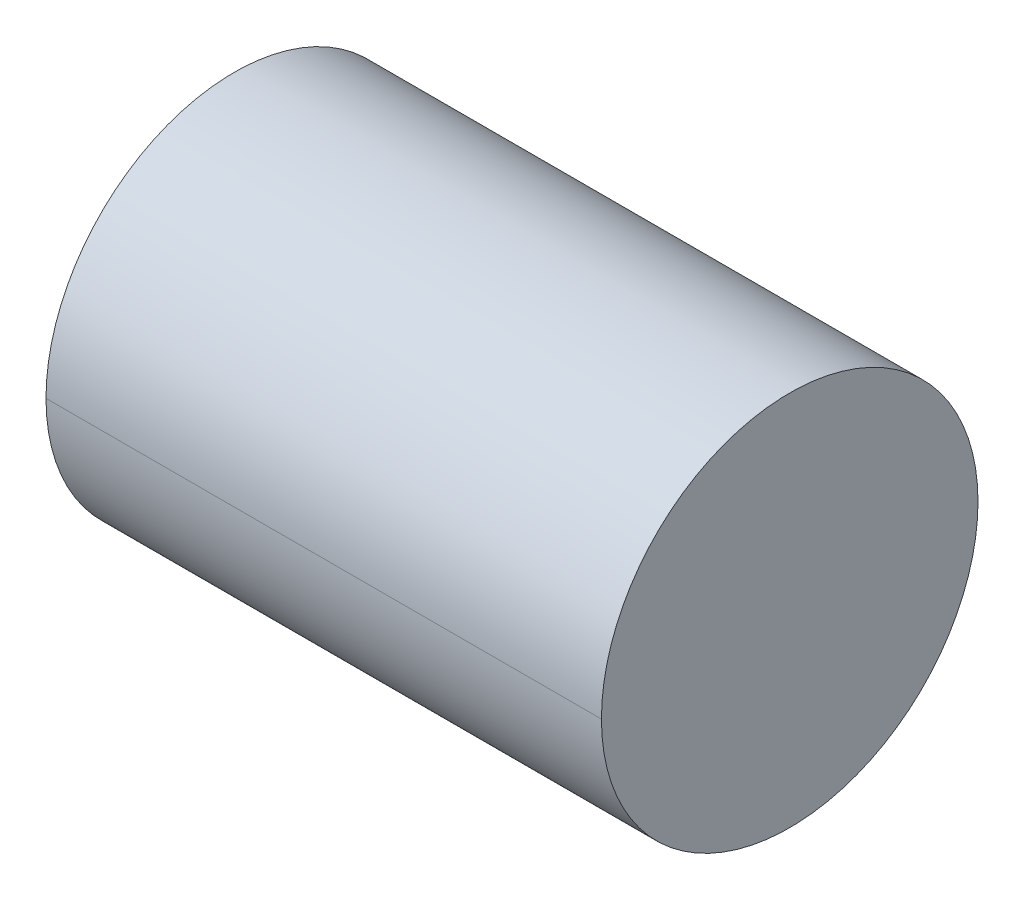
ISO-10303-21;
HEADER;
FILE_DESCRIPTION(('STEP AP214'),'2;1');
FILE_NAME('part.step','',(''),(''),'','','');
FILE_SCHEMA(('AUTOMOTIVE_DESIGN { 1 0 10303 214 1 1 1 1 }'));
ENDSEC;
DATA;
#1=APPLICATION_CONTEXT('core data for automotive mechanical design processes');
#2=APPLICATION_PROTOCOL_DEFINITION('international standard','automotive_design',2000,#1);
#3=PRODUCT_CONTEXT('',#1,'mechanical');
#4=PRODUCT('Part','Part','',(#3));
#5=PRODUCT_RELATED_PRODUCT_CATEGORY('part','',(#4));
#6=PRODUCT_DEFINITION_FORMATION('','',#4);
#7=PRODUCT_DEFINITION_CONTEXT('part definition',#1,'design');
#8=PRODUCT_DEFINITION('design','',#6,#7);
#9=PRODUCT_DEFINITION_SHAPE('','',#8);
#10=(LENGTH_UNIT() NAMED_UNIT(*) SI_UNIT(.MILLI.,.METRE.));
#11=(NAMED_UNIT(*) PLANE_ANGLE_UNIT() SI_UNIT($,.RADIAN.));
#12=(NAMED_UNIT(*) SI_UNIT($,.STERADIAN.) SOLID_ANGLE_UNIT());
#13=UNCERTAINTY_MEASURE_WITH_UNIT(LENGTH_MEASURE(1.E-05),#10,'distance_accuracy_value','');
#14=(GEOMETRIC_REPRESENTATION_CONTEXT(3) GLOBAL_UNCERTAINTY_ASSIGNED_CONTEXT((#13)) GLOBAL_UNIT_ASSIGNED_CONTEXT((#10,
#11,#12)) REPRESENTATION_CONTEXT('',''));
#15=CARTESIAN_POINT('',(0.,0.,0.));
#16=DIRECTION('',(0.,0.,1.));
#17=DIRECTION('',(1.,0.,0.));
#18=AXIS2_PLACEMENT_3D('',#15,#16,#17);
#19=CARTESIAN_POINT('',(75.45,0.,0.));
#20=DIRECTION('',(1.,0.,0.));
#21=DIRECTION('',(0.,1.,0.));
#22=AXIS2_PLACEMENT_3D('',#19,#20,#21);
#23=PLANE('',#22);
#24=CARTESIAN_POINT('',(75.45,0.,0.));
#25=DIRECTION('',(1.,0.,0.));
#26=DIRECTION('',(0.,0.,-1.));
#27=AXIS2_PLACEMENT_3D('',#24,#25,#26);
#28=CIRCLE('',#27,21.);
#29=CARTESIAN_POINT('',(75.45,0.,-21.));
#30=VERTEX_POINT('',#29);
#31=CARTESIAN_POINT('',(75.45,0.,21.));
#32=VERTEX_POINT('',#31);
#33=EDGE_CURVE('E65',#30,#32,#28,.T.);
#34=ORIENTED_EDGE('',*,*,#33,.T.);
#35=CARTESIAN_POINT('',(75.45,0.,0.));
#36=DIRECTION('',(1.,0.,0.));
#37=DIRECTION('',(0.,0.,-1.));
#38=AXIS2_PLACEMENT_3D('',#35,#36,#37);
#39=CIRCLE('',#38,21.);
#40=EDGE_CURVE('E28',#32,#30,#39,.T.);
#41=ORIENTED_EDGE('',*,*,#40,.T.);
#42=EDGE_LOOP('',(#34,#41));
#43=FACE_BOUND('',#42,.T.);
#44=ADVANCED_FACE('F17',(#43),#23,.T.);
#45=CARTESIAN_POINT('',(13.5,0.,0.));
#46=DIRECTION('',(-1.,0.,0.));
#47=DIRECTION('',(0.,0.,1.));
#48=AXIS2_PLACEMENT_3D('',#45,#46,#47);
#49=PLANE('',#48);
#50=CARTESIAN_POINT('',(13.5,0.,0.));
#51=DIRECTION('',(-1.,0.,0.));
#52=DIRECTION('',(0.,0.,-1.));
#53=AXIS2_PLACEMENT_3D('',#50,#51,#52);
#54=CIRCLE('',#53,21.);
#55=CARTESIAN_POINT('',(13.5,0.,-21.));
#56=VERTEX_POINT('',#55);
#57=CARTESIAN_POINT('',(13.5,0.,21.));
#58=VERTEX_POINT('',#57);
#59=EDGE_CURVE('E11',#56,#58,#54,.T.);
#60=ORIENTED_EDGE('',*,*,#59,.T.);
#61=CARTESIAN_POINT('',(13.5,0.,0.));
#62=DIRECTION('',(-1.,0.,0.));
#63=DIRECTION('',(0.,0.,-1.));
#64=AXIS2_PLACEMENT_3D('',#61,#62,#63);
#65=CIRCLE('',#64,21.);
#66=EDGE_CURVE('E59',#58,#56,#65,.T.);
#67=ORIENTED_EDGE('',*,*,#66,.T.);
#68=EDGE_LOOP('',(#60,#67));
#69=FACE_BOUND('',#68,.T.);
#70=ADVANCED_FACE('F60',(#69),#49,.T.);
#71=CARTESIAN_POINT('',(44.475,0.,0.));
#72=DIRECTION('',(1.,0.,0.));
#73=DIRECTION('',(0.,0.,-1.));
#74=AXIS2_PLACEMENT_3D('',#71,#72,#73);
#75=CYLINDRICAL_SURFACE('',#74,21.);
#76=DIRECTION('',(1.,0.,0.));
#77=VECTOR('',#76,1.);
#78=CARTESIAN_POINT('',(44.475,0.,-21.));
#79=LINE('',#78,#77);
#80=EDGE_CURVE('E21',#56,#30,#79,.T.);
#81=ORIENTED_EDGE('',*,*,#80,.T.);
#82=ORIENTED_EDGE('',*,*,#40,.F.);
#83=DIRECTION('',(-1.,0.,0.));
#84=VECTOR('',#83,1.);
#85=CARTESIAN_POINT('',(44.475,0.,21.));
#86=LINE('',#85,#84);
#87=EDGE_CURVE('E56',#32,#58,#86,.T.);
#88=ORIENTED_EDGE('',*,*,#87,.T.);
#89=ORIENTED_EDGE('',*,*,#59,.F.);
#90=EDGE_LOOP('',(#81,#82,#88,#89));
#91=FACE_BOUND('',#90,.T.);
#92=ADVANCED_FACE('F19',(#91),#75,.T.);
#93=CARTESIAN_POINT('',(44.475,0.,0.));
#94=DIRECTION('',(1.,0.,0.));
#95=DIRECTION('',(0.,0.,-1.));
#96=AXIS2_PLACEMENT_3D('',#93,#94,#95);
#97=CYLINDRICAL_SURFACE('',#96,21.);
#98=ORIENTED_EDGE('',*,*,#80,.F.);
#99=ORIENTED_EDGE('',*,*,#66,.F.);
#100=ORIENTED_EDGE('',*,*,#87,.F.);
#101=ORIENTED_EDGE('',*,*,#33,.F.);
#102=EDGE_LOOP('',(#98,#99,#100,#101));
#103=FACE_BOUND('',#102,.T.);
#104=ADVANCED_FACE('F64',(#103),#97,.T.);
#105=CLOSED_SHELL('',(#44,#70,#92,#104));
#106=MANIFOLD_SOLID_BREP('B1',#105);
#107=ADVANCED_BREP_SHAPE_REPRESENTATION('',(#18,#106),#14);
#108=SHAPE_DEFINITION_REPRESENTATION(#9,#107);
ENDSEC;
END-ISO-10303-21;
